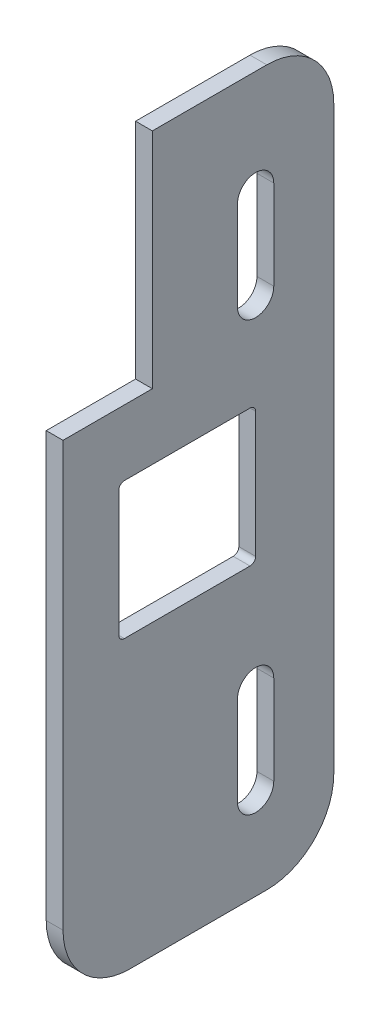
ISO-10303-21;
HEADER;
FILE_DESCRIPTION(('STEP AP214'),'2;1');
FILE_NAME('part.step','',(''),(''),'','','');
FILE_SCHEMA(('AUTOMOTIVE_DESIGN { 1 0 10303 214 1 1 1 1 }'));
ENDSEC;
DATA;
#1=APPLICATION_CONTEXT('core data for automotive mechanical design processes');
#2=APPLICATION_PROTOCOL_DEFINITION('international standard','automotive_design',2000,#1);
#3=PRODUCT_CONTEXT('',#1,'mechanical');
#4=PRODUCT('Part','Part','',(#3));
#5=PRODUCT_RELATED_PRODUCT_CATEGORY('part','',(#4));
#6=PRODUCT_DEFINITION_FORMATION('','',#4);
#7=PRODUCT_DEFINITION_CONTEXT('part definition',#1,'design');
#8=PRODUCT_DEFINITION('design','',#6,#7);
#9=PRODUCT_DEFINITION_SHAPE('','',#8);
#10=(LENGTH_UNIT() NAMED_UNIT(*) SI_UNIT(.MILLI.,.METRE.));
#11=(NAMED_UNIT(*) PLANE_ANGLE_UNIT() SI_UNIT($,.RADIAN.));
#12=(NAMED_UNIT(*) SI_UNIT($,.STERADIAN.) SOLID_ANGLE_UNIT());
#13=UNCERTAINTY_MEASURE_WITH_UNIT(LENGTH_MEASURE(1.E-05),#10,'distance_accuracy_value','');
#14=(GEOMETRIC_REPRESENTATION_CONTEXT(3) GLOBAL_UNCERTAINTY_ASSIGNED_CONTEXT((#13)) GLOBAL_UNIT_ASSIGNED_CONTEXT((#10,
#11,#12)) REPRESENTATION_CONTEXT('',''));
#15=CARTESIAN_POINT('',(0.,0.,0.));
#16=DIRECTION('',(0.,0.,1.));
#17=DIRECTION('',(1.,0.,0.));
#18=AXIS2_PLACEMENT_3D('',#15,#16,#17);
#19=CARTESIAN_POINT('',(-4.7752,-101.6,-41.6718749999999));
#20=DIRECTION('',(0.,0.,-1.));
#21=DIRECTION('',(0.,1.,0.));
#22=AXIS2_PLACEMENT_3D('',#19,#20,#21);
#23=PLANE('',#22);
#24=DIRECTION('',(0.,1.,0.));
#25=VECTOR('',#24,1.);
#26=CARTESIAN_POINT('',(0.,-101.6,-41.6718749999999));
#27=LINE('',#26,#25);
#28=CARTESIAN_POINT('',(0.,-82.55,-41.6718749999999));
#29=VERTEX_POINT('',#28);
#30=CARTESIAN_POINT('',(0.,82.55,-41.6718749999999));
#31=VERTEX_POINT('',#30);
#32=EDGE_CURVE('E236',#29,#31,#27,.T.);
#33=ORIENTED_EDGE('',*,*,#32,.F.);
#34=DIRECTION('',(1.,0.,0.));
#35=VECTOR('',#34,1.);
#36=CARTESIAN_POINT('',(-4.7752,-82.55,-41.6718749999999));
#37=LINE('',#36,#35);
#38=CARTESIAN_POINT('',(-4.7752,-82.55,-41.6718749999999));
#39=VERTEX_POINT('',#38);
#40=EDGE_CURVE('E291',#29,#39,#37,.F.);
#41=ORIENTED_EDGE('',*,*,#40,.T.);
#42=DIRECTION('',(0.,1.,0.));
#43=VECTOR('',#42,1.);
#44=CARTESIAN_POINT('',(-4.7752,-101.6,-41.6718749999999));
#45=LINE('',#44,#43);
#46=CARTESIAN_POINT('',(-4.7752,82.55,-41.6718749999999));
#47=VERTEX_POINT('',#46);
#48=EDGE_CURVE('E234',#39,#47,#45,.T.);
#49=ORIENTED_EDGE('',*,*,#48,.T.);
#50=DIRECTION('',(1.,0.,0.));
#51=VECTOR('',#50,1.);
#52=CARTESIAN_POINT('',(-4.7752,82.55,-41.6718749999999));
#53=LINE('',#52,#51);
#54=EDGE_CURVE('E288',#47,#31,#53,.T.);
#55=ORIENTED_EDGE('',*,*,#54,.T.);
#56=EDGE_LOOP('',(#33,#41,#49,#55));
#57=FACE_BOUND('',#56,.T.);
#58=ADVANCED_FACE('F44',(#57),#23,.T.);
#59=CARTESIAN_POINT('',(-4.7752,-101.6,35.3218750000001));
#60=DIRECTION('',(0.,-1.,0.));
#61=DIRECTION('',(0.,0.,-1.));
#62=AXIS2_PLACEMENT_3D('',#59,#60,#61);
#63=PLANE('',#62);
#64=DIRECTION('',(0.,0.,-1.));
#65=VECTOR('',#64,1.);
#66=CARTESIAN_POINT('',(-4.7752,-101.6,35.3218750000001));
#67=LINE('',#66,#65);
#68=CARTESIAN_POINT('',(-4.7752,-101.6,16.2718750000001));
#69=VERTEX_POINT('',#68);
#70=CARTESIAN_POINT('',(-4.7752,-101.6,-22.6218749999999));
#71=VERTEX_POINT('',#70);
#72=EDGE_CURVE('E243',#69,#71,#67,.T.);
#73=ORIENTED_EDGE('',*,*,#72,.T.);
#74=DIRECTION('',(1.,0.,0.));
#75=VECTOR('',#74,1.);
#76=CARTESIAN_POINT('',(-4.7752,-101.6,-22.6218749999999));
#77=LINE('',#76,#75);
#78=CARTESIAN_POINT('',(0.,-101.6,-22.6218749999999));
#79=VERTEX_POINT('',#78);
#80=EDGE_CURVE('E279',#71,#79,#77,.T.);
#81=ORIENTED_EDGE('',*,*,#80,.T.);
#82=DIRECTION('',(0.,0.,-1.));
#83=VECTOR('',#82,1.);
#84=CARTESIAN_POINT('',(0.,-101.6,35.3218750000001));
#85=LINE('',#84,#83);
#86=CARTESIAN_POINT('',(0.,-101.6,16.2718750000001));
#87=VERTEX_POINT('',#86);
#88=EDGE_CURVE('E230',#87,#79,#85,.T.);
#89=ORIENTED_EDGE('',*,*,#88,.F.);
#90=DIRECTION('',(1.,0.,0.));
#91=VECTOR('',#90,1.);
#92=CARTESIAN_POINT('',(-4.7752,-101.6,16.2718750000001));
#93=LINE('',#92,#91);
#94=EDGE_CURVE('E277',#87,#69,#93,.F.);
#95=ORIENTED_EDGE('',*,*,#94,.T.);
#96=EDGE_LOOP('',(#73,#81,#89,#95));
#97=FACE_BOUND('',#96,.T.);
#98=ADVANCED_FACE('F312',(#97),#63,.T.);
#99=CARTESIAN_POINT('',(-4.7752,-101.6,35.3218750000001));
#100=DIRECTION('',(0.,0.,1.));
#101=DIRECTION('',(0.,-1.,0.));
#102=AXIS2_PLACEMENT_3D('',#99,#100,#101);
#103=PLANE('',#102);
#104=DIRECTION('',(-1.,0.,0.));
#105=VECTOR('',#104,1.);
#106=CARTESIAN_POINT('',(0.,38.1,35.3218750000001));
#107=LINE('',#106,#105);
#108=CARTESIAN_POINT('',(0.,38.1,35.3218750000001));
#109=VERTEX_POINT('',#108);
#110=CARTESIAN_POINT('',(-4.7752,38.1,35.3218750000001));
#111=VERTEX_POINT('',#110);
#112=EDGE_CURVE('E209',#109,#111,#107,.T.);
#113=ORIENTED_EDGE('',*,*,#112,.T.);
#114=DIRECTION('',(0.,-1.,0.));
#115=VECTOR('',#114,1.);
#116=CARTESIAN_POINT('',(-4.7752,-101.6,35.3218750000001));
#117=LINE('',#116,#115);
#118=CARTESIAN_POINT('',(-4.7752,-82.55,35.3218750000001));
#119=VERTEX_POINT('',#118);
#120=EDGE_CURVE('E315',#111,#119,#117,.T.);
#121=ORIENTED_EDGE('',*,*,#120,.T.);
#122=DIRECTION('',(1.,0.,0.));
#123=VECTOR('',#122,1.);
#124=CARTESIAN_POINT('',(-4.7752,-82.55,35.3218750000001));
#125=LINE('',#124,#123);
#126=CARTESIAN_POINT('',(0.,-82.55,35.3218750000001));
#127=VERTEX_POINT('',#126);
#128=EDGE_CURVE('E52',#119,#127,#125,.T.);
#129=ORIENTED_EDGE('',*,*,#128,.T.);
#130=DIRECTION('',(0.,-1.,0.));
#131=VECTOR('',#130,1.);
#132=CARTESIAN_POINT('',(0.,-101.6,35.3218750000001));
#133=LINE('',#132,#131);
#134=EDGE_CURVE('E222',#109,#127,#133,.T.);
#135=ORIENTED_EDGE('',*,*,#134,.F.);
#136=EDGE_LOOP('',(#113,#121,#129,#135));
#137=FACE_BOUND('',#136,.T.);
#138=ADVANCED_FACE('F228',(#137),#103,.T.);
#139=CARTESIAN_POINT('',(-4.7752,101.6,35.3218750000001));
#140=DIRECTION('',(0.,1.,0.));
#141=DIRECTION('',(0.,0.,1.));
#142=AXIS2_PLACEMENT_3D('',#139,#140,#141);
#143=PLANE('',#142);
#144=DIRECTION('',(-1.,0.,0.));
#145=VECTOR('',#144,1.);
#146=CARTESIAN_POINT('',(0.,101.6,9.92187500000006));
#147=LINE('',#146,#145);
#148=CARTESIAN_POINT('',(0.,101.6,9.92187500000006));
#149=VERTEX_POINT('',#148);
#150=CARTESIAN_POINT('',(-4.7752,101.6,9.92187500000006));
#151=VERTEX_POINT('',#150);
#152=EDGE_CURVE('E216',#149,#151,#147,.T.);
#153=ORIENTED_EDGE('',*,*,#152,.F.);
#154=DIRECTION('',(0.,0.,1.));
#155=VECTOR('',#154,1.);
#156=CARTESIAN_POINT('',(0.,101.6,35.3218750000001));
#157=LINE('',#156,#155);
#158=CARTESIAN_POINT('',(0.,101.6,-22.6218749999999));
#159=VERTEX_POINT('',#158);
#160=EDGE_CURVE('E231',#159,#149,#157,.T.);
#161=ORIENTED_EDGE('',*,*,#160,.F.);
#162=DIRECTION('',(1.,0.,0.));
#163=VECTOR('',#162,1.);
#164=CARTESIAN_POINT('',(-4.7752,101.6,-22.6218749999999));
#165=LINE('',#164,#163);
#166=CARTESIAN_POINT('',(-4.7752,101.6,-22.6218749999999));
#167=VERTEX_POINT('',#166);
#168=EDGE_CURVE('E11',#159,#167,#165,.F.);
#169=ORIENTED_EDGE('',*,*,#168,.T.);
#170=DIRECTION('',(0.,0.,1.));
#171=VECTOR('',#170,1.);
#172=CARTESIAN_POINT('',(-4.7752,101.6,35.3218750000001));
#173=LINE('',#172,#171);
#174=EDGE_CURVE('E328',#167,#151,#173,.T.);
#175=ORIENTED_EDGE('',*,*,#174,.T.);
#176=EDGE_LOOP('',(#153,#161,#169,#175));
#177=FACE_BOUND('',#176,.T.);
#178=ADVANCED_FACE('F444',(#177),#143,.T.);
#179=CARTESIAN_POINT('',(-4.7752,0.,0.));
#180=DIRECTION('',(-1.,0.,0.));
#181=DIRECTION('',(0.,0.,1.));
#182=AXIS2_PLACEMENT_3D('',#179,#180,#181);
#183=PLANE('',#182);
#184=DIRECTION('',(0.,0.,1.));
#185=VECTOR('',#184,1.);
#186=CARTESIAN_POINT('',(-4.7752,38.1,9.92187500000006));
#187=LINE('',#186,#185);
#188=CARTESIAN_POINT('',(-4.7752,38.1,9.92187500000006));
#189=VERTEX_POINT('',#188);
#190=EDGE_CURVE('E212',#189,#111,#187,.T.);
#191=ORIENTED_EDGE('',*,*,#190,.F.);
#192=DIRECTION('',(0.,-1.,0.));
#193=VECTOR('',#192,1.);
#194=CARTESIAN_POINT('',(-4.7752,101.6,9.92187500000006));
#195=LINE('',#194,#193);
#196=EDGE_CURVE('E225',#151,#189,#195,.T.);
#197=ORIENTED_EDGE('',*,*,#196,.F.);
#198=ORIENTED_EDGE('',*,*,#174,.F.);
#199=CARTESIAN_POINT('',(-4.7752,82.55,-22.6218749999999));
#200=DIRECTION('',(-1.,0.,0.));
#201=DIRECTION('',(0.,0.,1.));
#202=AXIS2_PLACEMENT_3D('',#199,#200,#201);
#203=CIRCLE('',#202,19.05);
#204=EDGE_CURVE('E293',#167,#47,#203,.T.);
#205=ORIENTED_EDGE('',*,*,#204,.T.);
#206=ORIENTED_EDGE('',*,*,#48,.F.);
#207=CARTESIAN_POINT('',(-4.7752,-82.55,-22.6218749999999));
#208=DIRECTION('',(-1.,0.,0.));
#209=DIRECTION('',(0.,0.,1.));
#210=AXIS2_PLACEMENT_3D('',#207,#208,#209);
#211=CIRCLE('',#210,19.05);
#212=EDGE_CURVE('E298',#39,#71,#211,.T.);
#213=ORIENTED_EDGE('',*,*,#212,.T.);
#214=ORIENTED_EDGE('',*,*,#72,.F.);
#215=CARTESIAN_POINT('',(-4.7752,-82.55,16.2718750000001));
#216=DIRECTION('',(-1.,0.,0.));
#217=DIRECTION('',(0.,0.,1.));
#218=AXIS2_PLACEMENT_3D('',#215,#216,#217);
#219=CIRCLE('',#218,19.05);
#220=EDGE_CURVE('E295',#69,#119,#219,.T.);
#221=ORIENTED_EDGE('',*,*,#220,.T.);
#222=ORIENTED_EDGE('',*,*,#120,.F.);
#223=EDGE_LOOP('',(#191,#197,#198,#205,#206,#213,#214,#221,#222));
#224=FACE_BOUND('',#223,.T.);
#225=CARTESIAN_POINT('',(-4.7752,-75.803125,-19.4468749999999));
#226=DIRECTION('',(1.,0.,0.));
#227=DIRECTION('',(0.,0.,1.));
#228=AXIS2_PLACEMENT_3D('',#225,#226,#227);
#229=CIRCLE('',#228,5.15937500000007);
#230=CARTESIAN_POINT('',(-4.7752,-75.803125,-14.2874999999998));
#231=VERTEX_POINT('',#230);
#232=CARTESIAN_POINT('',(-4.7752,-75.803125,-24.60625));
#233=VERTEX_POINT('',#232);
#234=EDGE_CURVE('E396',#231,#233,#229,.T.);
#235=ORIENTED_EDGE('',*,*,#234,.T.);
#236=DIRECTION('',(0.,1.,0.));
#237=VECTOR('',#236,1.);
#238=CARTESIAN_POINT('',(-4.7752,-75.803125,-24.60625));
#239=LINE('',#238,#237);
#240=CARTESIAN_POINT('',(-4.7752,-50.403125,-24.60625));
#241=VERTEX_POINT('',#240);
#242=EDGE_CURVE('E411',#233,#241,#239,.T.);
#243=ORIENTED_EDGE('',*,*,#242,.T.);
#244=CARTESIAN_POINT('',(-4.7752,-50.403125,-19.446875));
#245=DIRECTION('',(1.,0.,0.));
#246=DIRECTION('',(0.,0.,1.));
#247=AXIS2_PLACEMENT_3D('',#244,#245,#246);
#248=CIRCLE('',#247,5.15937499999999);
#249=CARTESIAN_POINT('',(-4.7752,-50.403125,-14.2875));
#250=VERTEX_POINT('',#249);
#251=EDGE_CURVE('E408',#241,#250,#248,.T.);
#252=ORIENTED_EDGE('',*,*,#251,.T.);
#253=DIRECTION('',(0.,-1.,0.));
#254=VECTOR('',#253,1.);
#255=CARTESIAN_POINT('',(-4.7752,-75.803125,-14.2874999999998));
#256=LINE('',#255,#254);
#257=EDGE_CURVE('E388',#250,#231,#256,.T.);
#258=ORIENTED_EDGE('',*,*,#257,.T.);
#259=EDGE_LOOP('',(#235,#243,#252,#258));
#260=FACE_BOUND('',#259,.T.);
#261=CARTESIAN_POINT('',(-4.7752,71.4961598227845,-19.4468749999999));
#262=DIRECTION('',(1.,0.,0.));
#263=DIRECTION('',(0.,0.,-1.));
#264=AXIS2_PLACEMENT_3D('',#261,#262,#263);
#265=CIRCLE('',#264,5.15937500000007);
#266=CARTESIAN_POINT('',(-4.7752,71.4961598227845,-24.60625));
#267=VERTEX_POINT('',#266);
#268=CARTESIAN_POINT('',(-4.7752,71.4961598227845,-14.2874999999999));
#269=VERTEX_POINT('',#268);
#270=EDGE_CURVE('E364',#267,#269,#265,.T.);
#271=ORIENTED_EDGE('',*,*,#270,.T.);
#272=DIRECTION('',(0.,-1.,0.));
#273=VECTOR('',#272,1.);
#274=CARTESIAN_POINT('',(-4.7752,71.4961598227845,-14.2874999999999));
#275=LINE('',#274,#273);
#276=CARTESIAN_POINT('',(-4.7752,46.0961598227845,-14.2875));
#277=VERTEX_POINT('',#276);
#278=EDGE_CURVE('E379',#269,#277,#275,.T.);
#279=ORIENTED_EDGE('',*,*,#278,.T.);
#280=CARTESIAN_POINT('',(-4.7752,46.0961598227845,-19.446875));
#281=DIRECTION('',(1.,0.,0.));
#282=DIRECTION('',(0.,0.,-1.));
#283=AXIS2_PLACEMENT_3D('',#280,#281,#282);
#284=CIRCLE('',#283,5.15937499999999);
#285=CARTESIAN_POINT('',(-4.7752,46.0961598227845,-24.60625));
#286=VERTEX_POINT('',#285);
#287=EDGE_CURVE('E376',#277,#286,#284,.T.);
#288=ORIENTED_EDGE('',*,*,#287,.T.);
#289=DIRECTION('',(0.,1.,0.));
#290=VECTOR('',#289,1.);
#291=CARTESIAN_POINT('',(-4.7752,71.4961598227845,-24.60625));
#292=LINE('',#291,#290);
#293=EDGE_CURVE('E356',#286,#267,#292,.T.);
#294=ORIENTED_EDGE('',*,*,#293,.T.);
#295=EDGE_LOOP('',(#271,#279,#288,#294));
#296=FACE_BOUND('',#295,.T.);
#297=DIRECTION('',(0.,0.,1.));
#298=VECTOR('',#297,1.);
#299=CARTESIAN_POINT('',(-4.7752,19.446875,-19.446875));
#300=LINE('',#299,#298);
#301=CARTESIAN_POINT('',(-4.7752,19.446875,-17.859375));
#302=VERTEX_POINT('',#301);
#303=CARTESIAN_POINT('',(-4.7752,19.446875,17.859375));
#304=VERTEX_POINT('',#303);
#305=EDGE_CURVE('E322',#302,#304,#300,.T.);
#306=ORIENTED_EDGE('',*,*,#305,.T.);
#307=CARTESIAN_POINT('',(-4.7752,17.859375,17.859375));
#308=DIRECTION('',(-1.,0.,0.));
#309=DIRECTION('',(0.,0.,1.));
#310=AXIS2_PLACEMENT_3D('',#307,#308,#309);
#311=CIRCLE('',#310,1.5875);
#312=CARTESIAN_POINT('',(-4.7752,17.859375,19.446875));
#313=VERTEX_POINT('',#312);
#314=EDGE_CURVE('E263',#304,#313,#311,.F.);
#315=ORIENTED_EDGE('',*,*,#314,.T.);
#316=DIRECTION('',(0.,-1.,0.));
#317=VECTOR('',#316,1.);
#318=CARTESIAN_POINT('',(-4.7752,-19.446875,19.446875));
#319=LINE('',#318,#317);
#320=CARTESIAN_POINT('',(-4.7752,-17.859375,19.446875));
#321=VERTEX_POINT('',#320);
#322=EDGE_CURVE('E334',#313,#321,#319,.T.);
#323=ORIENTED_EDGE('',*,*,#322,.T.);
#324=CARTESIAN_POINT('',(-4.7752,-17.859375,17.859375));
#325=DIRECTION('',(-1.,0.,0.));
#326=DIRECTION('',(0.,0.,1.));
#327=AXIS2_PLACEMENT_3D('',#324,#325,#326);
#328=CIRCLE('',#327,1.5875);
#329=CARTESIAN_POINT('',(-4.7752,-19.446875,17.859375));
#330=VERTEX_POINT('',#329);
#331=EDGE_CURVE('E275',#321,#330,#328,.F.);
#332=ORIENTED_EDGE('',*,*,#331,.T.);
#333=DIRECTION('',(0.,0.,-1.));
#334=VECTOR('',#333,1.);
#335=CARTESIAN_POINT('',(-4.7752,-19.446875,-19.446875));
#336=LINE('',#335,#334);
#337=CARTESIAN_POINT('',(-4.7752,-19.446875,-17.859375));
#338=VERTEX_POINT('',#337);
#339=EDGE_CURVE('E347',#330,#338,#336,.T.);
#340=ORIENTED_EDGE('',*,*,#339,.T.);
#341=CARTESIAN_POINT('',(-4.7752,-17.859375,-17.859375));
#342=DIRECTION('',(-1.,0.,0.));
#343=DIRECTION('',(0.,0.,1.));
#344=AXIS2_PLACEMENT_3D('',#341,#342,#343);
#345=CIRCLE('',#344,1.5875);
#346=CARTESIAN_POINT('',(-4.7752,-17.859375,-19.446875));
#347=VERTEX_POINT('',#346);
#348=EDGE_CURVE('E271',#338,#347,#345,.F.);
#349=ORIENTED_EDGE('',*,*,#348,.T.);
#350=DIRECTION('',(0.,1.,0.));
#351=VECTOR('',#350,1.);
#352=CARTESIAN_POINT('',(-4.7752,-19.446875,-19.446875));
#353=LINE('',#352,#351);
#354=CARTESIAN_POINT('',(-4.7752,17.859375,-19.446875));
#355=VERTEX_POINT('',#354);
#356=EDGE_CURVE('E324',#347,#355,#353,.T.);
#357=ORIENTED_EDGE('',*,*,#356,.T.);
#358=CARTESIAN_POINT('',(-4.7752,17.859375,-17.859375));
#359=DIRECTION('',(-1.,0.,0.));
#360=DIRECTION('',(0.,0.,1.));
#361=AXIS2_PLACEMENT_3D('',#358,#359,#360);
#362=CIRCLE('',#361,1.5875);
#363=EDGE_CURVE('E267',#355,#302,#362,.F.);
#364=ORIENTED_EDGE('',*,*,#363,.T.);
#365=EDGE_LOOP('',(#306,#315,#323,#332,#340,#349,#357,#364));
#366=FACE_BOUND('',#365,.T.);
#367=ADVANCED_FACE('F304',(#224,#260,#296,#366),#183,.T.);
#368=CARTESIAN_POINT('',(0.,0.,0.));
#369=DIRECTION('',(-1.,0.,0.));
#370=DIRECTION('',(0.,0.,1.));
#371=AXIS2_PLACEMENT_3D('',#368,#369,#370);
#372=PLANE('',#371);
#373=DIRECTION('',(0.,1.,0.));
#374=VECTOR('',#373,1.);
#375=CARTESIAN_POINT('',(0.,-75.803125,-24.60625));
#376=LINE('',#375,#374);
#377=CARTESIAN_POINT('',(0.,-75.803125,-24.60625));
#378=VERTEX_POINT('',#377);
#379=CARTESIAN_POINT('',(0.,-50.403125,-24.60625));
#380=VERTEX_POINT('',#379);
#381=EDGE_CURVE('E400',#378,#380,#376,.T.);
#382=ORIENTED_EDGE('',*,*,#381,.F.);
#383=CARTESIAN_POINT('',(0.,-75.803125,-19.4468749999999));
#384=DIRECTION('',(1.,0.,0.));
#385=DIRECTION('',(0.,0.,1.));
#386=AXIS2_PLACEMENT_3D('',#383,#384,#385);
#387=CIRCLE('',#386,5.15937500000007);
#388=CARTESIAN_POINT('',(0.,-75.803125,-14.2874999999998));
#389=VERTEX_POINT('',#388);
#390=EDGE_CURVE('E403',#389,#378,#387,.T.);
#391=ORIENTED_EDGE('',*,*,#390,.F.);
#392=DIRECTION('',(0.,-1.,0.));
#393=VECTOR('',#392,1.);
#394=CARTESIAN_POINT('',(0.,-75.803125,-14.2874999999998));
#395=LINE('',#394,#393);
#396=CARTESIAN_POINT('',(0.,-50.403125,-14.2875));
#397=VERTEX_POINT('',#396);
#398=EDGE_CURVE('E393',#397,#389,#395,.T.);
#399=ORIENTED_EDGE('',*,*,#398,.F.);
#400=CARTESIAN_POINT('',(0.,-50.403125,-19.446875));
#401=DIRECTION('',(1.,0.,0.));
#402=DIRECTION('',(0.,0.,1.));
#403=AXIS2_PLACEMENT_3D('',#400,#401,#402);
#404=CIRCLE('',#403,5.15937499999999);
#405=EDGE_CURVE('E397',#380,#397,#404,.T.);
#406=ORIENTED_EDGE('',*,*,#405,.F.);
#407=EDGE_LOOP('',(#382,#391,#399,#406));
#408=FACE_BOUND('',#407,.T.);
#409=DIRECTION('',(0.,-1.,0.));
#410=VECTOR('',#409,1.);
#411=CARTESIAN_POINT('',(0.,71.4961598227845,-14.2874999999999));
#412=LINE('',#411,#410);
#413=CARTESIAN_POINT('',(0.,71.4961598227845,-14.2874999999999));
#414=VERTEX_POINT('',#413);
#415=CARTESIAN_POINT('',(0.,46.0961598227845,-14.2875));
#416=VERTEX_POINT('',#415);
#417=EDGE_CURVE('E368',#414,#416,#412,.T.);
#418=ORIENTED_EDGE('',*,*,#417,.F.);
#419=CARTESIAN_POINT('',(0.,71.4961598227845,-19.4468749999999));
#420=DIRECTION('',(1.,0.,0.));
#421=DIRECTION('',(0.,0.,-1.));
#422=AXIS2_PLACEMENT_3D('',#419,#420,#421);
#423=CIRCLE('',#422,5.15937500000007);
#424=CARTESIAN_POINT('',(0.,71.4961598227845,-24.60625));
#425=VERTEX_POINT('',#424);
#426=EDGE_CURVE('E371',#425,#414,#423,.T.);
#427=ORIENTED_EDGE('',*,*,#426,.F.);
#428=DIRECTION('',(0.,1.,0.));
#429=VECTOR('',#428,1.);
#430=CARTESIAN_POINT('',(0.,71.4961598227845,-24.60625));
#431=LINE('',#430,#429);
#432=CARTESIAN_POINT('',(0.,46.0961598227845,-24.60625));
#433=VERTEX_POINT('',#432);
#434=EDGE_CURVE('E361',#433,#425,#431,.T.);
#435=ORIENTED_EDGE('',*,*,#434,.F.);
#436=CARTESIAN_POINT('',(0.,46.0961598227845,-19.446875));
#437=DIRECTION('',(1.,0.,0.));
#438=DIRECTION('',(0.,0.,-1.));
#439=AXIS2_PLACEMENT_3D('',#436,#437,#438);
#440=CIRCLE('',#439,5.15937499999999);
#441=EDGE_CURVE('E365',#416,#433,#440,.T.);
#442=ORIENTED_EDGE('',*,*,#441,.F.);
#443=EDGE_LOOP('',(#418,#427,#435,#442));
#444=FACE_BOUND('',#443,.T.);
#445=DIRECTION('',(0.,0.,-1.));
#446=VECTOR('',#445,1.);
#447=CARTESIAN_POINT('',(0.,-19.446875,-19.446875));
#448=LINE('',#447,#446);
#449=CARTESIAN_POINT('',(0.,-19.446875,17.859375));
#450=VERTEX_POINT('',#449);
#451=CARTESIAN_POINT('',(0.,-19.446875,-17.859375));
#452=VERTEX_POINT('',#451);
#453=EDGE_CURVE('E338',#450,#452,#448,.T.);
#454=ORIENTED_EDGE('',*,*,#453,.F.);
#455=CARTESIAN_POINT('',(0.,-17.859375,17.859375));
#456=DIRECTION('',(-1.,0.,0.));
#457=DIRECTION('',(0.,0.,1.));
#458=AXIS2_PLACEMENT_3D('',#455,#456,#457);
#459=CIRCLE('',#458,1.5875);
#460=CARTESIAN_POINT('',(0.,-17.859375,19.446875));
#461=VERTEX_POINT('',#460);
#462=EDGE_CURVE('E273',#450,#461,#459,.T.);
#463=ORIENTED_EDGE('',*,*,#462,.T.);
#464=DIRECTION('',(0.,-1.,0.));
#465=VECTOR('',#464,1.);
#466=CARTESIAN_POINT('',(0.,-19.446875,19.446875));
#467=LINE('',#466,#465);
#468=CARTESIAN_POINT('',(0.,17.859375,19.446875));
#469=VERTEX_POINT('',#468);
#470=EDGE_CURVE('E341',#469,#461,#467,.T.);
#471=ORIENTED_EDGE('',*,*,#470,.F.);
#472=CARTESIAN_POINT('',(0.,17.859375,17.859375));
#473=DIRECTION('',(-1.,0.,0.));
#474=DIRECTION('',(0.,0.,1.));
#475=AXIS2_PLACEMENT_3D('',#472,#473,#474);
#476=CIRCLE('',#475,1.5875);
#477=CARTESIAN_POINT('',(0.,19.446875,17.859375));
#478=VERTEX_POINT('',#477);
#479=EDGE_CURVE('E261',#469,#478,#476,.T.);
#480=ORIENTED_EDGE('',*,*,#479,.T.);
#481=DIRECTION('',(0.,0.,1.));
#482=VECTOR('',#481,1.);
#483=CARTESIAN_POINT('',(0.,19.446875,-19.446875));
#484=LINE('',#483,#482);
#485=CARTESIAN_POINT('',(0.,19.446875,-17.859375));
#486=VERTEX_POINT('',#485);
#487=EDGE_CURVE('E331',#486,#478,#484,.T.);
#488=ORIENTED_EDGE('',*,*,#487,.F.);
#489=CARTESIAN_POINT('',(0.,17.859375,-17.859375));
#490=DIRECTION('',(-1.,0.,0.));
#491=DIRECTION('',(0.,0.,1.));
#492=AXIS2_PLACEMENT_3D('',#489,#490,#491);
#493=CIRCLE('',#492,1.5875);
#494=CARTESIAN_POINT('',(0.,17.859375,-19.446875));
#495=VERTEX_POINT('',#494);
#496=EDGE_CURVE('E265',#486,#495,#493,.T.);
#497=ORIENTED_EDGE('',*,*,#496,.T.);
#498=DIRECTION('',(0.,1.,0.));
#499=VECTOR('',#498,1.);
#500=CARTESIAN_POINT('',(0.,-19.446875,-19.446875));
#501=LINE('',#500,#499);
#502=CARTESIAN_POINT('',(0.,-17.859375,-19.446875));
#503=VERTEX_POINT('',#502);
#504=EDGE_CURVE('E335',#503,#495,#501,.T.);
#505=ORIENTED_EDGE('',*,*,#504,.F.);
#506=CARTESIAN_POINT('',(0.,-17.859375,-17.859375));
#507=DIRECTION('',(-1.,0.,0.));
#508=DIRECTION('',(0.,0.,1.));
#509=AXIS2_PLACEMENT_3D('',#506,#507,#508);
#510=CIRCLE('',#509,1.5875);
#511=EDGE_CURVE('E269',#503,#452,#510,.T.);
#512=ORIENTED_EDGE('',*,*,#511,.T.);
#513=EDGE_LOOP('',(#454,#463,#471,#480,#488,#497,#505,#512));
#514=FACE_BOUND('',#513,.T.);
#515=DIRECTION('',(0.,-1.,0.));
#516=VECTOR('',#515,1.);
#517=CARTESIAN_POINT('',(0.,101.6,9.92187500000006));
#518=LINE('',#517,#516);
#519=CARTESIAN_POINT('',(0.,38.1,9.92187500000006));
#520=VERTEX_POINT('',#519);
#521=EDGE_CURVE('E217',#149,#520,#518,.T.);
#522=ORIENTED_EDGE('',*,*,#521,.T.);
#523=DIRECTION('',(0.,0.,1.));
#524=VECTOR('',#523,1.);
#525=CARTESIAN_POINT('',(0.,38.1,9.92187500000006));
#526=LINE('',#525,#524);
#527=EDGE_CURVE('E59',#520,#109,#526,.T.);
#528=ORIENTED_EDGE('',*,*,#527,.T.);
#529=ORIENTED_EDGE('',*,*,#134,.T.);
#530=CARTESIAN_POINT('',(0.,-82.55,16.2718750000001));
#531=DIRECTION('',(-1.,0.,0.));
#532=DIRECTION('',(0.,0.,1.));
#533=AXIS2_PLACEMENT_3D('',#530,#531,#532);
#534=CIRCLE('',#533,19.05);
#535=EDGE_CURVE('E284',#127,#87,#534,.F.);
#536=ORIENTED_EDGE('',*,*,#535,.T.);
#537=ORIENTED_EDGE('',*,*,#88,.T.);
#538=CARTESIAN_POINT('',(0.,-82.55,-22.6218749999999));
#539=DIRECTION('',(-1.,0.,0.));
#540=DIRECTION('',(0.,0.,1.));
#541=AXIS2_PLACEMENT_3D('',#538,#539,#540);
#542=CIRCLE('',#541,19.05);
#543=EDGE_CURVE('E286',#79,#29,#542,.F.);
#544=ORIENTED_EDGE('',*,*,#543,.T.);
#545=ORIENTED_EDGE('',*,*,#32,.T.);
#546=CARTESIAN_POINT('',(0.,82.55,-22.6218749999999));
#547=DIRECTION('',(-1.,0.,0.));
#548=DIRECTION('',(0.,0.,1.));
#549=AXIS2_PLACEMENT_3D('',#546,#547,#548);
#550=CIRCLE('',#549,19.05);
#551=EDGE_CURVE('E282',#31,#159,#550,.F.);
#552=ORIENTED_EDGE('',*,*,#551,.T.);
#553=ORIENTED_EDGE('',*,*,#160,.T.);
#554=EDGE_LOOP('',(#522,#528,#529,#536,#537,#544,#545,#552,#553));
#555=FACE_BOUND('',#554,.T.);
#556=ADVANCED_FACE('F221',(#408,#444,#514,#555),#372,.F.);
#557=CARTESIAN_POINT('',(-4.7752,-19.446875,19.446875));
#558=DIRECTION('',(0.,0.,1.));
#559=DIRECTION('',(1.,0.,0.));
#560=AXIS2_PLACEMENT_3D('',#557,#558,#559);
#561=PLANE('',#560);
#562=ORIENTED_EDGE('',*,*,#322,.F.);
#563=DIRECTION('',(1.,0.,0.));
#564=VECTOR('',#563,1.);
#565=CARTESIAN_POINT('',(0.,17.859375,19.446875));
#566=LINE('',#565,#564);
#567=EDGE_CURVE('E242',#313,#469,#566,.T.);
#568=ORIENTED_EDGE('',*,*,#567,.T.);
#569=ORIENTED_EDGE('',*,*,#470,.T.);
#570=DIRECTION('',(1.,0.,0.));
#571=VECTOR('',#570,1.);
#572=CARTESIAN_POINT('',(-4.7752,-17.859375,19.446875));
#573=LINE('',#572,#571);
#574=EDGE_CURVE('E240',#461,#321,#573,.F.);
#575=ORIENTED_EDGE('',*,*,#574,.T.);
#576=EDGE_LOOP('',(#562,#568,#569,#575));
#577=FACE_BOUND('',#576,.T.);
#578=ADVANCED_FACE('F489',(#577),#561,.F.);
#579=CARTESIAN_POINT('',(-4.7752,19.446875,-19.446875));
#580=DIRECTION('',(0.,1.,0.));
#581=DIRECTION('',(0.,0.,1.));
#582=AXIS2_PLACEMENT_3D('',#579,#580,#581);
#583=PLANE('',#582);
#584=ORIENTED_EDGE('',*,*,#487,.T.);
#585=DIRECTION('',(1.,0.,0.));
#586=VECTOR('',#585,1.);
#587=CARTESIAN_POINT('',(-4.7752,19.446875,17.859375));
#588=LINE('',#587,#586);
#589=EDGE_CURVE('E249',#478,#304,#588,.F.);
#590=ORIENTED_EDGE('',*,*,#589,.T.);
#591=ORIENTED_EDGE('',*,*,#305,.F.);
#592=DIRECTION('',(1.,0.,0.));
#593=VECTOR('',#592,1.);
#594=CARTESIAN_POINT('',(0.,19.446875,-17.859375));
#595=LINE('',#594,#593);
#596=EDGE_CURVE('E246',#302,#486,#595,.T.);
#597=ORIENTED_EDGE('',*,*,#596,.T.);
#598=EDGE_LOOP('',(#584,#590,#591,#597));
#599=FACE_BOUND('',#598,.T.);
#600=ADVANCED_FACE('F484',(#599),#583,.F.);
#601=CARTESIAN_POINT('',(-4.7752,-19.446875,-19.446875));
#602=DIRECTION('',(0.,0.,-1.));
#603=DIRECTION('',(0.,1.,0.));
#604=AXIS2_PLACEMENT_3D('',#601,#602,#603);
#605=PLANE('',#604);
#606=ORIENTED_EDGE('',*,*,#504,.T.);
#607=DIRECTION('',(1.,0.,0.));
#608=VECTOR('',#607,1.);
#609=CARTESIAN_POINT('',(-4.7752,17.859375,-19.446875));
#610=LINE('',#609,#608);
#611=EDGE_CURVE('E254',#495,#355,#610,.F.);
#612=ORIENTED_EDGE('',*,*,#611,.T.);
#613=ORIENTED_EDGE('',*,*,#356,.F.);
#614=DIRECTION('',(1.,0.,0.));
#615=VECTOR('',#614,1.);
#616=CARTESIAN_POINT('',(0.,-17.859375,-19.446875));
#617=LINE('',#616,#615);
#618=EDGE_CURVE('E251',#347,#503,#617,.T.);
#619=ORIENTED_EDGE('',*,*,#618,.T.);
#620=EDGE_LOOP('',(#606,#612,#613,#619));
#621=FACE_BOUND('',#620,.T.);
#622=ADVANCED_FACE('F477',(#621),#605,.F.);
#623=CARTESIAN_POINT('',(-4.7752,-19.446875,-19.446875));
#624=DIRECTION('',(0.,-1.,0.));
#625=DIRECTION('',(0.,0.,-1.));
#626=AXIS2_PLACEMENT_3D('',#623,#624,#625);
#627=PLANE('',#626);
#628=ORIENTED_EDGE('',*,*,#453,.T.);
#629=DIRECTION('',(1.,0.,0.));
#630=VECTOR('',#629,1.);
#631=CARTESIAN_POINT('',(-4.7752,-19.446875,-17.859375));
#632=LINE('',#631,#630);
#633=EDGE_CURVE('E259',#452,#338,#632,.F.);
#634=ORIENTED_EDGE('',*,*,#633,.T.);
#635=ORIENTED_EDGE('',*,*,#339,.F.);
#636=DIRECTION('',(1.,0.,0.));
#637=VECTOR('',#636,1.);
#638=CARTESIAN_POINT('',(0.,-19.446875,17.859375));
#639=LINE('',#638,#637);
#640=EDGE_CURVE('E256',#330,#450,#639,.T.);
#641=ORIENTED_EDGE('',*,*,#640,.T.);
#642=EDGE_LOOP('',(#628,#634,#635,#641));
#643=FACE_BOUND('',#642,.T.);
#644=ADVANCED_FACE('F470',(#643),#627,.F.);
#645=CARTESIAN_POINT('',(-4.7752,71.4961598227845,-19.4468749999999));
#646=DIRECTION('',(1.,0.,0.));
#647=DIRECTION('',(0.,0.,-1.));
#648=AXIS2_PLACEMENT_3D('',#645,#646,#647);
#649=CYLINDRICAL_SURFACE('',#648,5.15937500000007);
#650=ORIENTED_EDGE('',*,*,#426,.T.);
#651=DIRECTION('',(1.,0.,0.));
#652=VECTOR('',#651,1.);
#653=CARTESIAN_POINT('',(-4.7752,71.4961598227845,-14.2874999999999));
#654=LINE('',#653,#652);
#655=EDGE_CURVE('E352',#269,#414,#654,.T.);
#656=ORIENTED_EDGE('',*,*,#655,.F.);
#657=ORIENTED_EDGE('',*,*,#270,.F.);
#658=DIRECTION('',(1.,0.,0.));
#659=VECTOR('',#658,1.);
#660=CARTESIAN_POINT('',(-4.7752,71.4961598227845,-24.60625));
#661=LINE('',#660,#659);
#662=EDGE_CURVE('E343',#267,#425,#661,.T.);
#663=ORIENTED_EDGE('',*,*,#662,.T.);
#664=EDGE_LOOP('',(#650,#656,#657,#663));
#665=FACE_BOUND('',#664,.T.);
#666=ADVANCED_FACE('F558',(#665),#649,.F.);
#667=CARTESIAN_POINT('',(-4.7752,71.4961598227845,-24.60625));
#668=DIRECTION('',(0.,0.,-1.));
#669=DIRECTION('',(0.,1.,0.));
#670=AXIS2_PLACEMENT_3D('',#667,#668,#669);
#671=PLANE('',#670);
#672=ORIENTED_EDGE('',*,*,#434,.T.);
#673=ORIENTED_EDGE('',*,*,#662,.F.);
#674=ORIENTED_EDGE('',*,*,#293,.F.);
#675=DIRECTION('',(1.,0.,0.));
#676=VECTOR('',#675,1.);
#677=CARTESIAN_POINT('',(-4.7752,46.0961598227845,-24.60625));
#678=LINE('',#677,#676);
#679=EDGE_CURVE('E358',#286,#433,#678,.T.);
#680=ORIENTED_EDGE('',*,*,#679,.T.);
#681=EDGE_LOOP('',(#672,#673,#674,#680));
#682=FACE_BOUND('',#681,.T.);
#683=ADVANCED_FACE('F568',(#682),#671,.F.);
#684=CARTESIAN_POINT('',(-4.7752,46.0961598227845,-19.446875));
#685=DIRECTION('',(1.,0.,0.));
#686=DIRECTION('',(0.,0.,-1.));
#687=AXIS2_PLACEMENT_3D('',#684,#685,#686);
#688=CYLINDRICAL_SURFACE('',#687,5.15937499999999);
#689=ORIENTED_EDGE('',*,*,#441,.T.);
#690=ORIENTED_EDGE('',*,*,#679,.F.);
#691=ORIENTED_EDGE('',*,*,#287,.F.);
#692=DIRECTION('',(1.,0.,0.));
#693=VECTOR('',#692,1.);
#694=CARTESIAN_POINT('',(-4.7752,46.0961598227845,-14.2875));
#695=LINE('',#694,#693);
#696=EDGE_CURVE('E355',#277,#416,#695,.T.);
#697=ORIENTED_EDGE('',*,*,#696,.T.);
#698=EDGE_LOOP('',(#689,#690,#691,#697));
#699=FACE_BOUND('',#698,.T.);
#700=ADVANCED_FACE('F579',(#699),#688,.F.);
#701=CARTESIAN_POINT('',(-4.7752,71.4961598227845,-14.2874999999999));
#702=DIRECTION('',(0.,0.,1.));
#703=DIRECTION('',(0.,-1.,0.));
#704=AXIS2_PLACEMENT_3D('',#701,#702,#703);
#705=PLANE('',#704);
#706=ORIENTED_EDGE('',*,*,#417,.T.);
#707=ORIENTED_EDGE('',*,*,#696,.F.);
#708=ORIENTED_EDGE('',*,*,#278,.F.);
#709=ORIENTED_EDGE('',*,*,#655,.T.);
#710=EDGE_LOOP('',(#706,#707,#708,#709));
#711=FACE_BOUND('',#710,.T.);
#712=ADVANCED_FACE('F590',(#711),#705,.F.);
#713=CARTESIAN_POINT('',(-4.7752,-75.803125,-19.4468749999999));
#714=DIRECTION('',(1.,0.,0.));
#715=DIRECTION('',(0.,0.,-1.));
#716=AXIS2_PLACEMENT_3D('',#713,#714,#715);
#717=CYLINDRICAL_SURFACE('',#716,5.15937500000007);
#718=ORIENTED_EDGE('',*,*,#390,.T.);
#719=DIRECTION('',(1.,0.,0.));
#720=VECTOR('',#719,1.);
#721=CARTESIAN_POINT('',(-4.7752,-75.803125,-24.60625));
#722=LINE('',#721,#720);
#723=EDGE_CURVE('E384',#233,#378,#722,.T.);
#724=ORIENTED_EDGE('',*,*,#723,.F.);
#725=ORIENTED_EDGE('',*,*,#234,.F.);
#726=DIRECTION('',(1.,0.,0.));
#727=VECTOR('',#726,1.);
#728=CARTESIAN_POINT('',(-4.7752,-75.803125,-14.2874999999998));
#729=LINE('',#728,#727);
#730=EDGE_CURVE('E373',#231,#389,#729,.T.);
#731=ORIENTED_EDGE('',*,*,#730,.T.);
#732=EDGE_LOOP('',(#718,#724,#725,#731));
#733=FACE_BOUND('',#732,.T.);
#734=ADVANCED_FACE('F601',(#733),#717,.F.);
#735=CARTESIAN_POINT('',(-4.7752,-75.803125,-14.2874999999998));
#736=DIRECTION('',(0.,0.,1.));
#737=DIRECTION('',(0.,-1.,0.));
#738=AXIS2_PLACEMENT_3D('',#735,#736,#737);
#739=PLANE('',#738);
#740=ORIENTED_EDGE('',*,*,#398,.T.);
#741=ORIENTED_EDGE('',*,*,#730,.F.);
#742=ORIENTED_EDGE('',*,*,#257,.F.);
#743=DIRECTION('',(1.,0.,0.));
#744=VECTOR('',#743,1.);
#745=CARTESIAN_POINT('',(-4.7752,-50.403125,-14.2875));
#746=LINE('',#745,#744);
#747=EDGE_CURVE('E390',#250,#397,#746,.T.);
#748=ORIENTED_EDGE('',*,*,#747,.T.);
#749=EDGE_LOOP('',(#740,#741,#742,#748));
#750=FACE_BOUND('',#749,.T.);
#751=ADVANCED_FACE('F612',(#750),#739,.F.);
#752=CARTESIAN_POINT('',(-4.7752,-50.403125,-19.446875));
#753=DIRECTION('',(1.,0.,0.));
#754=DIRECTION('',(0.,0.,-1.));
#755=AXIS2_PLACEMENT_3D('',#752,#753,#754);
#756=CYLINDRICAL_SURFACE('',#755,5.15937499999999);
#757=ORIENTED_EDGE('',*,*,#405,.T.);
#758=ORIENTED_EDGE('',*,*,#747,.F.);
#759=ORIENTED_EDGE('',*,*,#251,.F.);
#760=DIRECTION('',(1.,0.,0.));
#761=VECTOR('',#760,1.);
#762=CARTESIAN_POINT('',(-4.7752,-50.403125,-24.60625));
#763=LINE('',#762,#761);
#764=EDGE_CURVE('E387',#241,#380,#763,.T.);
#765=ORIENTED_EDGE('',*,*,#764,.T.);
#766=EDGE_LOOP('',(#757,#758,#759,#765));
#767=FACE_BOUND('',#766,.T.);
#768=ADVANCED_FACE('F623',(#767),#756,.F.);
#769=CARTESIAN_POINT('',(-4.7752,-75.803125,-24.60625));
#770=DIRECTION('',(0.,0.,-1.));
#771=DIRECTION('',(0.,1.,0.));
#772=AXIS2_PLACEMENT_3D('',#769,#770,#771);
#773=PLANE('',#772);
#774=ORIENTED_EDGE('',*,*,#381,.T.);
#775=ORIENTED_EDGE('',*,*,#764,.F.);
#776=ORIENTED_EDGE('',*,*,#242,.F.);
#777=ORIENTED_EDGE('',*,*,#723,.T.);
#778=EDGE_LOOP('',(#774,#775,#776,#777));
#779=FACE_BOUND('',#778,.T.);
#780=ADVANCED_FACE('F450',(#779),#773,.F.);
#781=CARTESIAN_POINT('',(-4.7752,17.859375,17.859375));
#782=DIRECTION('',(-1.,0.,0.));
#783=DIRECTION('',(0.,0.,1.));
#784=AXIS2_PLACEMENT_3D('',#781,#782,#783);
#785=CYLINDRICAL_SURFACE('',#784,1.5875);
#786=ORIENTED_EDGE('',*,*,#314,.F.);
#787=ORIENTED_EDGE('',*,*,#589,.F.);
#788=ORIENTED_EDGE('',*,*,#479,.F.);
#789=ORIENTED_EDGE('',*,*,#567,.F.);
#790=EDGE_LOOP('',(#786,#787,#788,#789));
#791=FACE_BOUND('',#790,.T.);
#792=ADVANCED_FACE('F446',(#791),#785,.F.);
#793=CARTESIAN_POINT('',(-4.7752,17.859375,-17.859375));
#794=DIRECTION('',(-1.,0.,0.));
#795=DIRECTION('',(0.,0.,1.));
#796=AXIS2_PLACEMENT_3D('',#793,#794,#795);
#797=CYLINDRICAL_SURFACE('',#796,1.5875);
#798=ORIENTED_EDGE('',*,*,#363,.F.);
#799=ORIENTED_EDGE('',*,*,#611,.F.);
#800=ORIENTED_EDGE('',*,*,#496,.F.);
#801=ORIENTED_EDGE('',*,*,#596,.F.);
#802=EDGE_LOOP('',(#798,#799,#800,#801));
#803=FACE_BOUND('',#802,.T.);
#804=ADVANCED_FACE('F449',(#803),#797,.F.);
#805=CARTESIAN_POINT('',(-4.7752,-17.859375,-17.859375));
#806=DIRECTION('',(-1.,0.,0.));
#807=DIRECTION('',(0.,0.,1.));
#808=AXIS2_PLACEMENT_3D('',#805,#806,#807);
#809=CYLINDRICAL_SURFACE('',#808,1.5875);
#810=ORIENTED_EDGE('',*,*,#348,.F.);
#811=ORIENTED_EDGE('',*,*,#633,.F.);
#812=ORIENTED_EDGE('',*,*,#511,.F.);
#813=ORIENTED_EDGE('',*,*,#618,.F.);
#814=EDGE_LOOP('',(#810,#811,#812,#813));
#815=FACE_BOUND('',#814,.T.);
#816=ADVANCED_FACE('F454',(#815),#809,.F.);
#817=CARTESIAN_POINT('',(-4.7752,-17.859375,17.859375));
#818=DIRECTION('',(-1.,0.,0.));
#819=DIRECTION('',(0.,0.,1.));
#820=AXIS2_PLACEMENT_3D('',#817,#818,#819);
#821=CYLINDRICAL_SURFACE('',#820,1.5875);
#822=ORIENTED_EDGE('',*,*,#331,.F.);
#823=ORIENTED_EDGE('',*,*,#574,.F.);
#824=ORIENTED_EDGE('',*,*,#462,.F.);
#825=ORIENTED_EDGE('',*,*,#640,.F.);
#826=EDGE_LOOP('',(#822,#823,#824,#825));
#827=FACE_BOUND('',#826,.T.);
#828=ADVANCED_FACE('F433',(#827),#821,.F.);
#829=CARTESIAN_POINT('',(-4.7752,-82.55,-22.6218749999999));
#830=DIRECTION('',(1.,0.,0.));
#831=DIRECTION('',(0.,0.,-1.));
#832=AXIS2_PLACEMENT_3D('',#829,#830,#831);
#833=CYLINDRICAL_SURFACE('',#832,19.05);
#834=ORIENTED_EDGE('',*,*,#212,.F.);
#835=ORIENTED_EDGE('',*,*,#40,.F.);
#836=ORIENTED_EDGE('',*,*,#543,.F.);
#837=ORIENTED_EDGE('',*,*,#80,.F.);
#838=EDGE_LOOP('',(#834,#835,#836,#837));
#839=FACE_BOUND('',#838,.T.);
#840=ADVANCED_FACE('F317',(#839),#833,.T.);
#841=CARTESIAN_POINT('',(-4.7752,-82.55,16.2718750000001));
#842=DIRECTION('',(1.,0.,0.));
#843=DIRECTION('',(0.,0.,-1.));
#844=AXIS2_PLACEMENT_3D('',#841,#842,#843);
#845=CYLINDRICAL_SURFACE('',#844,19.05);
#846=ORIENTED_EDGE('',*,*,#220,.F.);
#847=ORIENTED_EDGE('',*,*,#94,.F.);
#848=ORIENTED_EDGE('',*,*,#535,.F.);
#849=ORIENTED_EDGE('',*,*,#128,.F.);
#850=EDGE_LOOP('',(#846,#847,#848,#849));
#851=FACE_BOUND('',#850,.T.);
#852=ADVANCED_FACE('F426',(#851),#845,.T.);
#853=CARTESIAN_POINT('',(-4.7752,82.55,-22.6218749999999));
#854=DIRECTION('',(1.,0.,0.));
#855=DIRECTION('',(0.,0.,-1.));
#856=AXIS2_PLACEMENT_3D('',#853,#854,#855);
#857=CYLINDRICAL_SURFACE('',#856,19.05);
#858=ORIENTED_EDGE('',*,*,#204,.F.);
#859=ORIENTED_EDGE('',*,*,#168,.F.);
#860=ORIENTED_EDGE('',*,*,#551,.F.);
#861=ORIENTED_EDGE('',*,*,#54,.F.);
#862=EDGE_LOOP('',(#858,#859,#860,#861));
#863=FACE_BOUND('',#862,.T.);
#864=ADVANCED_FACE('F46',(#863),#857,.T.);
#865=CARTESIAN_POINT('',(0.,38.1,9.92187500000006));
#866=DIRECTION('',(0.,-1.,0.));
#867=DIRECTION('',(0.,0.,-1.));
#868=AXIS2_PLACEMENT_3D('',#865,#866,#867);
#869=PLANE('',#868);
#870=ORIENTED_EDGE('',*,*,#190,.T.);
#871=ORIENTED_EDGE('',*,*,#112,.F.);
#872=ORIENTED_EDGE('',*,*,#527,.F.);
#873=DIRECTION('',(-1.,0.,0.));
#874=VECTOR('',#873,1.);
#875=CARTESIAN_POINT('',(0.,38.1,9.92187500000006));
#876=LINE('',#875,#874);
#877=EDGE_CURVE('E405',#520,#189,#876,.T.);
#878=ORIENTED_EDGE('',*,*,#877,.T.);
#879=EDGE_LOOP('',(#870,#871,#872,#878));
#880=FACE_BOUND('',#879,.T.);
#881=ADVANCED_FACE('F210',(#880),#869,.F.);
#882=CARTESIAN_POINT('',(0.,101.6,9.92187500000006));
#883=DIRECTION('',(0.,0.,-1.));
#884=DIRECTION('',(-1.,0.,0.));
#885=AXIS2_PLACEMENT_3D('',#882,#883,#884);
#886=PLANE('',#885);
#887=ORIENTED_EDGE('',*,*,#196,.T.);
#888=ORIENTED_EDGE('',*,*,#877,.F.);
#889=ORIENTED_EDGE('',*,*,#521,.F.);
#890=ORIENTED_EDGE('',*,*,#152,.T.);
#891=EDGE_LOOP('',(#887,#888,#889,#890));
#892=FACE_BOUND('',#891,.T.);
#893=ADVANCED_FACE('F423',(#892),#886,.F.);
#894=CLOSED_SHELL('',(#58,#98,#138,#178,#367,#556,#578,#600,#622,#644,#666,#683,#700,#712,#734,
#751,#768,#780,#792,#804,#816,#828,#840,#852,#864,#881,#893));
#895=MANIFOLD_SOLID_BREP('B2',#894);
#896=ADVANCED_BREP_SHAPE_REPRESENTATION('',(#18,#895),#14);
#897=SHAPE_DEFINITION_REPRESENTATION(#9,#896);
ENDSEC;
END-ISO-10303-21;
